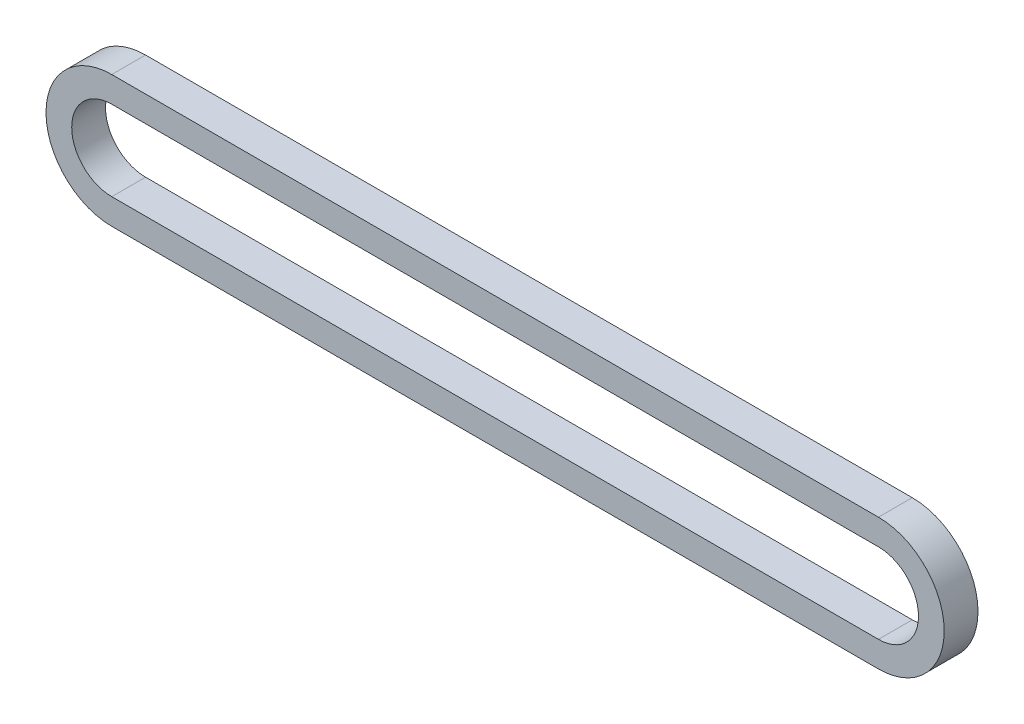
ISO-10303-21;
HEADER;
FILE_DESCRIPTION(('STEP AP214'),'2;1');
FILE_NAME('part.step','',(''),(''),'','','');
FILE_SCHEMA(('AUTOMOTIVE_DESIGN { 1 0 10303 214 1 1 1 1 }'));
ENDSEC;
DATA;
#1=APPLICATION_CONTEXT('core data for automotive mechanical design processes');
#2=APPLICATION_PROTOCOL_DEFINITION('international standard','automotive_design',2000,#1);
#3=PRODUCT_CONTEXT('',#1,'mechanical');
#4=PRODUCT('Part','Part','',(#3));
#5=PRODUCT_RELATED_PRODUCT_CATEGORY('part','',(#4));
#6=PRODUCT_DEFINITION_FORMATION('','',#4);
#7=PRODUCT_DEFINITION_CONTEXT('part definition',#1,'design');
#8=PRODUCT_DEFINITION('design','',#6,#7);
#9=PRODUCT_DEFINITION_SHAPE('','',#8);
#10=(LENGTH_UNIT() NAMED_UNIT(*) SI_UNIT(.MILLI.,.METRE.));
#11=(NAMED_UNIT(*) PLANE_ANGLE_UNIT() SI_UNIT($,.RADIAN.));
#12=(NAMED_UNIT(*) SI_UNIT($,.STERADIAN.) SOLID_ANGLE_UNIT());
#13=UNCERTAINTY_MEASURE_WITH_UNIT(LENGTH_MEASURE(1.E-05),#10,'distance_accuracy_value','');
#14=(GEOMETRIC_REPRESENTATION_CONTEXT(3) GLOBAL_UNCERTAINTY_ASSIGNED_CONTEXT((#13)) GLOBAL_UNIT_ASSIGNED_CONTEXT((#10,
#11,#12)) REPRESENTATION_CONTEXT('',''));
#15=CARTESIAN_POINT('',(0.,0.,0.));
#16=DIRECTION('',(0.,0.,1.));
#17=DIRECTION('',(1.,0.,0.));
#18=AXIS2_PLACEMENT_3D('',#15,#16,#17);
#19=CARTESIAN_POINT('',(0.,0.,5.8801));
#20=DIRECTION('',(0.,0.,1.));
#21=DIRECTION('',(1.,0.,0.));
#22=AXIS2_PLACEMENT_3D('',#19,#20,#21);
#23=PLANE('',#22);
#24=CARTESIAN_POINT('',(0.,0.,5.8801));
#25=DIRECTION('',(0.,0.,1.));
#26=DIRECTION('',(1.,0.,0.));
#27=AXIS2_PLACEMENT_3D('',#24,#25,#26);
#28=CIRCLE('',#27,22.8712869908068);
#29=CARTESIAN_POINT('',(0.,22.8712869908068,5.8801));
#30=VERTEX_POINT('',#29);
#31=CARTESIAN_POINT('',(0.,-22.8712869908068,5.8801));
#32=VERTEX_POINT('',#31);
#33=EDGE_CURVE('E161',#30,#32,#28,.T.);
#34=ORIENTED_EDGE('',*,*,#33,.T.);
#35=DIRECTION('',(1.,0.,0.));
#36=VECTOR('',#35,1.);
#37=CARTESIAN_POINT('',(0.,-22.8712869908068,5.8801));
#38=LINE('',#37,#36);
#39=CARTESIAN_POINT('',(266.7,-22.8712869908068,5.8801));
#40=VERTEX_POINT('',#39);
#41=EDGE_CURVE('E164',#32,#40,#38,.T.);
#42=ORIENTED_EDGE('',*,*,#41,.T.);
#43=CARTESIAN_POINT('',(266.7,0.,5.8801));
#44=DIRECTION('',(0.,0.,1.));
#45=DIRECTION('',(1.,0.,0.));
#46=AXIS2_PLACEMENT_3D('',#43,#44,#45);
#47=CIRCLE('',#46,22.8712869908068);
#48=CARTESIAN_POINT('',(266.7,22.8712869908068,5.8801));
#49=VERTEX_POINT('',#48);
#50=EDGE_CURVE('E167',#40,#49,#47,.T.);
#51=ORIENTED_EDGE('',*,*,#50,.T.);
#52=DIRECTION('',(-1.,0.,0.));
#53=VECTOR('',#52,1.);
#54=CARTESIAN_POINT('',(0.,22.8712869908068,5.8801));
#55=LINE('',#54,#53);
#56=EDGE_CURVE('E169',#49,#30,#55,.T.);
#57=ORIENTED_EDGE('',*,*,#56,.T.);
#58=EDGE_LOOP('',(#34,#42,#51,#57));
#59=FACE_BOUND('',#58,.T.);
#60=DIRECTION('',(1.,0.,0.));
#61=VECTOR('',#60,1.);
#62=CARTESIAN_POINT('',(0.,-13.9304869908068,5.8801));
#63=LINE('',#62,#61);
#64=CARTESIAN_POINT('',(0.,-13.9304869908068,5.8801));
#65=VERTEX_POINT('',#64);
#66=CARTESIAN_POINT('',(266.7,-13.9304869908068,5.8801));
#67=VERTEX_POINT('',#66);
#68=EDGE_CURVE('E133',#65,#67,#63,.T.);
#69=ORIENTED_EDGE('',*,*,#68,.F.);
#70=CARTESIAN_POINT('',(0.,0.,5.8801));
#71=DIRECTION('',(0.,0.,1.));
#72=DIRECTION('',(1.,0.,0.));
#73=AXIS2_PLACEMENT_3D('',#70,#71,#72);
#74=CIRCLE('',#73,13.9304869908068);
#75=CARTESIAN_POINT('',(0.,13.9304869908068,5.8801));
#76=VERTEX_POINT('',#75);
#77=EDGE_CURVE('E125',#76,#65,#74,.T.);
#78=ORIENTED_EDGE('',*,*,#77,.F.);
#79=DIRECTION('',(-1.,0.,0.));
#80=VECTOR('',#79,1.);
#81=CARTESIAN_POINT('',(0.,13.9304869908068,5.8801));
#82=LINE('',#81,#80);
#83=CARTESIAN_POINT('',(266.7,13.9304869908068,5.8801));
#84=VERTEX_POINT('',#83);
#85=EDGE_CURVE('E147',#84,#76,#82,.T.);
#86=ORIENTED_EDGE('',*,*,#85,.F.);
#87=CARTESIAN_POINT('',(266.7,0.,5.8801));
#88=DIRECTION('',(0.,0.,1.));
#89=DIRECTION('',(1.,0.,0.));
#90=AXIS2_PLACEMENT_3D('',#87,#88,#89);
#91=CIRCLE('',#90,13.9304869908068);
#92=EDGE_CURVE('E145',#67,#84,#91,.T.);
#93=ORIENTED_EDGE('',*,*,#92,.F.);
#94=EDGE_LOOP('',(#69,#78,#86,#93));
#95=FACE_BOUND('',#94,.T.);
#96=ADVANCED_FACE('F60',(#59,#95),#23,.T.);
#97=CARTESIAN_POINT('',(0.,0.,-5.8801));
#98=DIRECTION('',(0.,0.,1.));
#99=DIRECTION('',(1.,0.,0.));
#100=AXIS2_PLACEMENT_3D('',#97,#98,#99);
#101=PLANE('',#100);
#102=CARTESIAN_POINT('',(0.,0.,-5.8801));
#103=DIRECTION('',(0.,0.,1.));
#104=DIRECTION('',(1.,0.,0.));
#105=AXIS2_PLACEMENT_3D('',#102,#103,#104);
#106=CIRCLE('',#105,22.8712869908068);
#107=CARTESIAN_POINT('',(0.,22.8712869908068,-5.8801));
#108=VERTEX_POINT('',#107);
#109=CARTESIAN_POINT('',(0.,-22.8712869908068,-5.8801));
#110=VERTEX_POINT('',#109);
#111=EDGE_CURVE('E141',#108,#110,#106,.T.);
#112=ORIENTED_EDGE('',*,*,#111,.F.);
#113=DIRECTION('',(-1.,0.,0.));
#114=VECTOR('',#113,1.);
#115=CARTESIAN_POINT('',(0.,22.8712869908068,-5.8801));
#116=LINE('',#115,#114);
#117=CARTESIAN_POINT('',(266.7,22.8712869908068,-5.8801));
#118=VERTEX_POINT('',#117);
#119=EDGE_CURVE('E165',#118,#108,#116,.T.);
#120=ORIENTED_EDGE('',*,*,#119,.F.);
#121=CARTESIAN_POINT('',(266.7,0.,-5.8801));
#122=DIRECTION('',(0.,0.,1.));
#123=DIRECTION('',(1.,0.,0.));
#124=AXIS2_PLACEMENT_3D('',#121,#122,#123);
#125=CIRCLE('',#124,22.8712869908068);
#126=CARTESIAN_POINT('',(266.7,-22.8712869908068,-5.8801));
#127=VERTEX_POINT('',#126);
#128=EDGE_CURVE('E176',#127,#118,#125,.T.);
#129=ORIENTED_EDGE('',*,*,#128,.F.);
#130=DIRECTION('',(1.,0.,0.));
#131=VECTOR('',#130,1.);
#132=CARTESIAN_POINT('',(0.,-22.8712869908068,-5.8801));
#133=LINE('',#132,#131);
#134=EDGE_CURVE('E174',#110,#127,#133,.T.);
#135=ORIENTED_EDGE('',*,*,#134,.F.);
#136=EDGE_LOOP('',(#112,#120,#129,#135));
#137=FACE_BOUND('',#136,.T.);
#138=CARTESIAN_POINT('',(0.,0.,-5.8801));
#139=DIRECTION('',(0.,0.,1.));
#140=DIRECTION('',(1.,0.,0.));
#141=AXIS2_PLACEMENT_3D('',#138,#139,#140);
#142=CIRCLE('',#141,13.9304869908068);
#143=CARTESIAN_POINT('',(0.,13.9304869908068,-5.8801));
#144=VERTEX_POINT('',#143);
#145=CARTESIAN_POINT('',(0.,-13.9304869908068,-5.8801));
#146=VERTEX_POINT('',#145);
#147=EDGE_CURVE('E83',#144,#146,#142,.T.);
#148=ORIENTED_EDGE('',*,*,#147,.T.);
#149=DIRECTION('',(1.,0.,0.));
#150=VECTOR('',#149,1.);
#151=CARTESIAN_POINT('',(0.,-13.9304869908068,-5.8801));
#152=LINE('',#151,#150);
#153=CARTESIAN_POINT('',(266.7,-13.9304869908068,-5.8801));
#154=VERTEX_POINT('',#153);
#155=EDGE_CURVE('E140',#146,#154,#152,.T.);
#156=ORIENTED_EDGE('',*,*,#155,.T.);
#157=CARTESIAN_POINT('',(266.7,0.,-5.8801));
#158=DIRECTION('',(0.,0.,1.));
#159=DIRECTION('',(1.,0.,0.));
#160=AXIS2_PLACEMENT_3D('',#157,#158,#159);
#161=CIRCLE('',#160,13.9304869908068);
#162=CARTESIAN_POINT('',(266.7,13.9304869908068,-5.8801));
#163=VERTEX_POINT('',#162);
#164=EDGE_CURVE('E153',#154,#163,#161,.T.);
#165=ORIENTED_EDGE('',*,*,#164,.T.);
#166=DIRECTION('',(-1.,0.,0.));
#167=VECTOR('',#166,1.);
#168=CARTESIAN_POINT('',(0.,13.9304869908068,-5.8801));
#169=LINE('',#168,#167);
#170=EDGE_CURVE('E134',#163,#144,#169,.T.);
#171=ORIENTED_EDGE('',*,*,#170,.T.);
#172=EDGE_LOOP('',(#148,#156,#165,#171));
#173=FACE_BOUND('',#172,.T.);
#174=ADVANCED_FACE('F194',(#137,#173),#101,.F.);
#175=CARTESIAN_POINT('',(0.,0.,5.8801));
#176=DIRECTION('',(0.,0.,-1.));
#177=DIRECTION('',(-1.,0.,0.));
#178=AXIS2_PLACEMENT_3D('',#175,#176,#177);
#179=CYLINDRICAL_SURFACE('',#178,22.8712869908068);
#180=ORIENTED_EDGE('',*,*,#111,.T.);
#181=DIRECTION('',(0.,0.,-1.));
#182=VECTOR('',#181,1.);
#183=CARTESIAN_POINT('',(0.,-22.8712869908068,5.8801));
#184=LINE('',#183,#182);
#185=EDGE_CURVE('E12',#32,#110,#184,.T.);
#186=ORIENTED_EDGE('',*,*,#185,.F.);
#187=ORIENTED_EDGE('',*,*,#33,.F.);
#188=DIRECTION('',(0.,0.,-1.));
#189=VECTOR('',#188,1.);
#190=CARTESIAN_POINT('',(0.,22.8712869908068,5.8801));
#191=LINE('',#190,#189);
#192=EDGE_CURVE('E171',#30,#108,#191,.T.);
#193=ORIENTED_EDGE('',*,*,#192,.T.);
#194=EDGE_LOOP('',(#180,#186,#187,#193));
#195=FACE_BOUND('',#194,.T.);
#196=ADVANCED_FACE('F62',(#195),#179,.T.);
#197=CARTESIAN_POINT('',(0.,-22.8712869908068,5.8801));
#198=DIRECTION('',(0.,1.,0.));
#199=DIRECTION('',(0.,0.,1.));
#200=AXIS2_PLACEMENT_3D('',#197,#198,#199);
#201=PLANE('',#200);
#202=ORIENTED_EDGE('',*,*,#134,.T.);
#203=DIRECTION('',(0.,0.,-1.));
#204=VECTOR('',#203,1.);
#205=CARTESIAN_POINT('',(266.7,-22.8712869908068,5.8801));
#206=LINE('',#205,#204);
#207=EDGE_CURVE('E68',#40,#127,#206,.T.);
#208=ORIENTED_EDGE('',*,*,#207,.F.);
#209=ORIENTED_EDGE('',*,*,#41,.F.);
#210=ORIENTED_EDGE('',*,*,#185,.T.);
#211=EDGE_LOOP('',(#202,#208,#209,#210));
#212=FACE_BOUND('',#211,.T.);
#213=ADVANCED_FACE('F204',(#212),#201,.F.);
#214=CARTESIAN_POINT('',(266.7,0.,5.8801));
#215=DIRECTION('',(0.,0.,-1.));
#216=DIRECTION('',(-1.,0.,0.));
#217=AXIS2_PLACEMENT_3D('',#214,#215,#216);
#218=CYLINDRICAL_SURFACE('',#217,22.8712869908068);
#219=ORIENTED_EDGE('',*,*,#128,.T.);
#220=DIRECTION('',(0.,0.,-1.));
#221=VECTOR('',#220,1.);
#222=CARTESIAN_POINT('',(266.7,22.8712869908068,5.8801));
#223=LINE('',#222,#221);
#224=EDGE_CURVE('E181',#49,#118,#223,.T.);
#225=ORIENTED_EDGE('',*,*,#224,.F.);
#226=ORIENTED_EDGE('',*,*,#50,.F.);
#227=ORIENTED_EDGE('',*,*,#207,.T.);
#228=EDGE_LOOP('',(#219,#225,#226,#227));
#229=FACE_BOUND('',#228,.T.);
#230=ADVANCED_FACE('F188',(#229),#218,.T.);
#231=CARTESIAN_POINT('',(0.,22.8712869908068,5.8801));
#232=DIRECTION('',(0.,-1.,0.));
#233=DIRECTION('',(0.,0.,-1.));
#234=AXIS2_PLACEMENT_3D('',#231,#232,#233);
#235=PLANE('',#234);
#236=ORIENTED_EDGE('',*,*,#119,.T.);
#237=ORIENTED_EDGE('',*,*,#192,.F.);
#238=ORIENTED_EDGE('',*,*,#56,.F.);
#239=ORIENTED_EDGE('',*,*,#224,.T.);
#240=EDGE_LOOP('',(#236,#237,#238,#239));
#241=FACE_BOUND('',#240,.T.);
#242=ADVANCED_FACE('F198',(#241),#235,.F.);
#243=CARTESIAN_POINT('',(0.,0.,5.8801));
#244=DIRECTION('',(0.,0.,-1.));
#245=DIRECTION('',(-1.,0.,0.));
#246=AXIS2_PLACEMENT_3D('',#243,#244,#245);
#247=CYLINDRICAL_SURFACE('',#246,13.9304869908068);
#248=ORIENTED_EDGE('',*,*,#147,.F.);
#249=DIRECTION('',(0.,0.,-1.));
#250=VECTOR('',#249,1.);
#251=CARTESIAN_POINT('',(0.,13.9304869908068,5.8801));
#252=LINE('',#251,#250);
#253=EDGE_CURVE('E129',#76,#144,#252,.T.);
#254=ORIENTED_EDGE('',*,*,#253,.F.);
#255=ORIENTED_EDGE('',*,*,#77,.T.);
#256=DIRECTION('',(0.,0.,-1.));
#257=VECTOR('',#256,1.);
#258=CARTESIAN_POINT('',(0.,-13.9304869908068,5.8801));
#259=LINE('',#258,#257);
#260=EDGE_CURVE('E128',#65,#146,#259,.T.);
#261=ORIENTED_EDGE('',*,*,#260,.T.);
#262=EDGE_LOOP('',(#248,#254,#255,#261));
#263=FACE_BOUND('',#262,.T.);
#264=ADVANCED_FACE('F127',(#263),#247,.F.);
#265=CARTESIAN_POINT('',(0.,-13.9304869908068,5.8801));
#266=DIRECTION('',(0.,1.,0.));
#267=DIRECTION('',(0.,0.,1.));
#268=AXIS2_PLACEMENT_3D('',#265,#266,#267);
#269=PLANE('',#268);
#270=ORIENTED_EDGE('',*,*,#155,.F.);
#271=ORIENTED_EDGE('',*,*,#260,.F.);
#272=ORIENTED_EDGE('',*,*,#68,.T.);
#273=DIRECTION('',(0.,0.,-1.));
#274=VECTOR('',#273,1.);
#275=CARTESIAN_POINT('',(266.7,-13.9304869908068,5.8801));
#276=LINE('',#275,#274);
#277=EDGE_CURVE('E142',#67,#154,#276,.T.);
#278=ORIENTED_EDGE('',*,*,#277,.T.);
#279=EDGE_LOOP('',(#270,#271,#272,#278));
#280=FACE_BOUND('',#279,.T.);
#281=ADVANCED_FACE('F137',(#280),#269,.T.);
#282=CARTESIAN_POINT('',(266.7,0.,5.8801));
#283=DIRECTION('',(0.,0.,-1.));
#284=DIRECTION('',(-1.,0.,0.));
#285=AXIS2_PLACEMENT_3D('',#282,#283,#284);
#286=CYLINDRICAL_SURFACE('',#285,13.9304869908068);
#287=ORIENTED_EDGE('',*,*,#164,.F.);
#288=ORIENTED_EDGE('',*,*,#277,.F.);
#289=ORIENTED_EDGE('',*,*,#92,.T.);
#290=DIRECTION('',(0.,0.,-1.));
#291=VECTOR('',#290,1.);
#292=CARTESIAN_POINT('',(266.7,13.9304869908068,5.8801));
#293=LINE('',#292,#291);
#294=EDGE_CURVE('E75',#84,#163,#293,.T.);
#295=ORIENTED_EDGE('',*,*,#294,.T.);
#296=EDGE_LOOP('',(#287,#288,#289,#295));
#297=FACE_BOUND('',#296,.T.);
#298=ADVANCED_FACE('F227',(#297),#286,.F.);
#299=CARTESIAN_POINT('',(0.,13.9304869908068,5.8801));
#300=DIRECTION('',(0.,-1.,0.));
#301=DIRECTION('',(0.,0.,-1.));
#302=AXIS2_PLACEMENT_3D('',#299,#300,#301);
#303=PLANE('',#302);
#304=ORIENTED_EDGE('',*,*,#170,.F.);
#305=ORIENTED_EDGE('',*,*,#294,.F.);
#306=ORIENTED_EDGE('',*,*,#85,.T.);
#307=ORIENTED_EDGE('',*,*,#253,.T.);
#308=EDGE_LOOP('',(#304,#305,#306,#307));
#309=FACE_BOUND('',#308,.T.);
#310=ADVANCED_FACE('F231',(#309),#303,.T.);
#311=CLOSED_SHELL('',(#96,#174,#196,#213,#230,#242,#264,#281,#298,#310));
#312=MANIFOLD_SOLID_BREP('B2',#311);
#313=ADVANCED_BREP_SHAPE_REPRESENTATION('',(#18,#312),#14);
#314=SHAPE_DEFINITION_REPRESENTATION(#9,#313);
ENDSEC;
END-ISO-10303-21;
